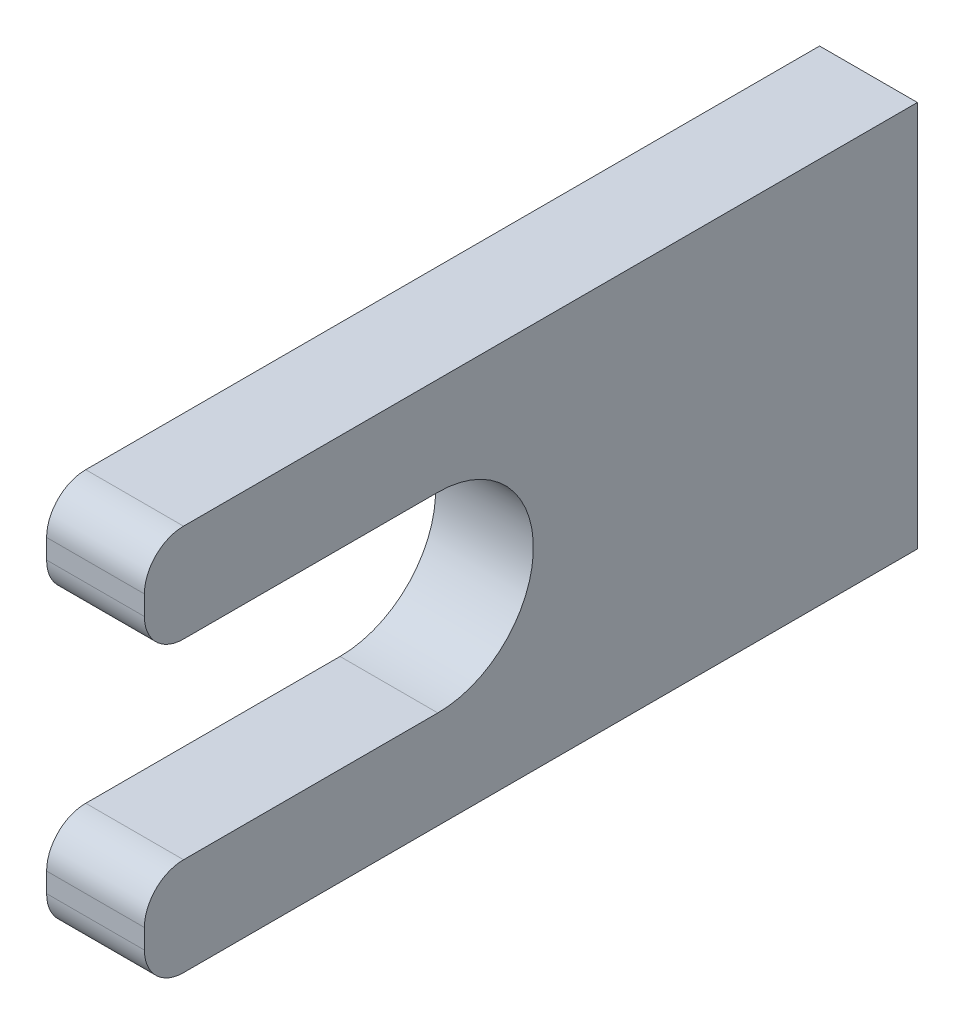
ISO-10303-21;
HEADER;
FILE_DESCRIPTION(('STEP AP214'),'2;1');
FILE_NAME('part.step','',(''),(''),'','','');
FILE_SCHEMA(('AUTOMOTIVE_DESIGN { 1 0 10303 214 1 1 1 1 }'));
ENDSEC;
DATA;
#1=APPLICATION_CONTEXT('core data for automotive mechanical design processes');
#2=APPLICATION_PROTOCOL_DEFINITION('international standard','automotive_design',2000,#1);
#3=PRODUCT_CONTEXT('',#1,'mechanical');
#4=PRODUCT('Part','Part','',(#3));
#5=PRODUCT_RELATED_PRODUCT_CATEGORY('part','',(#4));
#6=PRODUCT_DEFINITION_FORMATION('','',#4);
#7=PRODUCT_DEFINITION_CONTEXT('part definition',#1,'design');
#8=PRODUCT_DEFINITION('design','',#6,#7);
#9=PRODUCT_DEFINITION_SHAPE('','',#8);
#10=(LENGTH_UNIT() NAMED_UNIT(*) SI_UNIT(.MILLI.,.METRE.));
#11=(NAMED_UNIT(*) PLANE_ANGLE_UNIT() SI_UNIT($,.RADIAN.));
#12=(NAMED_UNIT(*) SI_UNIT($,.STERADIAN.) SOLID_ANGLE_UNIT());
#13=UNCERTAINTY_MEASURE_WITH_UNIT(LENGTH_MEASURE(1.E-05),#10,'distance_accuracy_value','');
#14=(GEOMETRIC_REPRESENTATION_CONTEXT(3) GLOBAL_UNCERTAINTY_ASSIGNED_CONTEXT((#13)) GLOBAL_UNIT_ASSIGNED_CONTEXT((#10,
#11,#12)) REPRESENTATION_CONTEXT('',''));
#15=CARTESIAN_POINT('',(0.,0.,0.));
#16=DIRECTION('',(0.,0.,1.));
#17=DIRECTION('',(1.,0.,0.));
#18=AXIS2_PLACEMENT_3D('',#15,#16,#17);
#19=CARTESIAN_POINT('',(-70.825,6.203199938,488.95));
#20=DIRECTION('',(0.,0.,-1.));
#21=DIRECTION('',(-1.,0.,0.));
#22=AXIS2_PLACEMENT_3D('',#19,#20,#21);
#23=PLANE('',#22);
#24=DIRECTION('',(0.,-1.,0.));
#25=VECTOR('',#24,1.);
#26=CARTESIAN_POINT('',(-77.175,6.203199938,488.95));
#27=LINE('',#26,#25);
#28=CARTESIAN_POINT('',(-77.175,10.013199938,488.95));
#29=VERTEX_POINT('',#28);
#30=CARTESIAN_POINT('',(-77.175,8.743199938,488.95));
#31=VERTEX_POINT('',#30);
#32=EDGE_CURVE('E166',#29,#31,#27,.T.);
#33=ORIENTED_EDGE('',*,*,#32,.T.);
#34=DIRECTION('',(-1.,0.,0.));
#35=VECTOR('',#34,1.);
#36=CARTESIAN_POINT('',(-70.825,8.743199938,488.95));
#37=LINE('',#36,#35);
#38=CARTESIAN_POINT('',(-70.825,8.743199938,488.95));
#39=VERTEX_POINT('',#38);
#40=EDGE_CURVE('E203',#31,#39,#37,.F.);
#41=ORIENTED_EDGE('',*,*,#40,.T.);
#42=DIRECTION('',(0.,-1.,0.));
#43=VECTOR('',#42,1.);
#44=CARTESIAN_POINT('',(-70.825,6.203199938,488.95));
#45=LINE('',#44,#43);
#46=CARTESIAN_POINT('',(-70.825,10.013199938,488.95));
#47=VERTEX_POINT('',#46);
#48=EDGE_CURVE('E137',#47,#39,#45,.T.);
#49=ORIENTED_EDGE('',*,*,#48,.F.);
#50=DIRECTION('',(-1.,0.,0.));
#51=VECTOR('',#50,1.);
#52=CARTESIAN_POINT('',(-70.825,10.013199938,488.95));
#53=LINE('',#52,#51);
#54=EDGE_CURVE('E200',#47,#29,#53,.T.);
#55=ORIENTED_EDGE('',*,*,#54,.T.);
#56=EDGE_LOOP('',(#33,#41,#49,#55));
#57=FACE_BOUND('',#56,.T.);
#58=ADVANCED_FACE('F36',(#57),#23,.F.);
#59=CARTESIAN_POINT('',(-70.825,6.203199938,488.95));
#60=DIRECTION('',(0.,1.,0.));
#61=DIRECTION('',(0.,0.,1.));
#62=AXIS2_PLACEMENT_3D('',#59,#60,#61);
#63=PLANE('',#62);
#64=DIRECTION('',(0.,0.,-1.));
#65=VECTOR('',#64,1.);
#66=CARTESIAN_POINT('',(-70.825,6.203199938,488.95));
#67=LINE('',#66,#65);
#68=CARTESIAN_POINT('',(-70.825,6.203199938,486.41));
#69=VERTEX_POINT('',#68);
#70=CARTESIAN_POINT('',(-70.825,6.203199938,469.9));
#71=VERTEX_POINT('',#70);
#72=EDGE_CURVE('E124',#69,#71,#67,.T.);
#73=ORIENTED_EDGE('',*,*,#72,.F.);
#74=DIRECTION('',(-1.,0.,0.));
#75=VECTOR('',#74,1.);
#76=CARTESIAN_POINT('',(-70.825,6.203199938,486.41));
#77=LINE('',#76,#75);
#78=CARTESIAN_POINT('',(-77.175,6.203199938,486.41));
#79=VERTEX_POINT('',#78);
#80=EDGE_CURVE('E146',#69,#79,#77,.T.);
#81=ORIENTED_EDGE('',*,*,#80,.T.);
#82=DIRECTION('',(0.,0.,-1.));
#83=VECTOR('',#82,1.);
#84=CARTESIAN_POINT('',(-77.175,6.203199938,488.95));
#85=LINE('',#84,#83);
#86=CARTESIAN_POINT('',(-77.175,6.203199938,469.9));
#87=VERTEX_POINT('',#86);
#88=EDGE_CURVE('E143',#79,#87,#85,.T.);
#89=ORIENTED_EDGE('',*,*,#88,.T.);
#90=DIRECTION('',(-1.,0.,0.));
#91=VECTOR('',#90,1.);
#92=CARTESIAN_POINT('',(-70.825,6.203199938,469.9));
#93=LINE('',#92,#91);
#94=EDGE_CURVE('E140',#71,#87,#93,.T.);
#95=ORIENTED_EDGE('',*,*,#94,.F.);
#96=EDGE_LOOP('',(#73,#81,#89,#95));
#97=FACE_BOUND('',#96,.T.);
#98=ADVANCED_FACE('F141',(#97),#63,.F.);
#99=CARTESIAN_POINT('',(-70.825,0.,469.9));
#100=DIRECTION('',(-1.,0.,0.));
#101=DIRECTION('',(0.,0.,1.));
#102=AXIS2_PLACEMENT_3D('',#99,#100,#101);
#103=CYLINDRICAL_SURFACE('',#102,6.203199938);
#104=CARTESIAN_POINT('',(-77.175,0.,469.9));
#105=DIRECTION('',(-1.,0.,0.));
#106=DIRECTION('',(0.,0.,1.));
#107=AXIS2_PLACEMENT_3D('',#104,#105,#106);
#108=CIRCLE('',#107,6.203199938);
#109=CARTESIAN_POINT('',(-77.175,-6.203199938,469.9));
#110=VERTEX_POINT('',#109);
#111=EDGE_CURVE('E170',#87,#110,#108,.T.);
#112=ORIENTED_EDGE('',*,*,#111,.T.);
#113=DIRECTION('',(-1.,0.,0.));
#114=VECTOR('',#113,1.);
#115=CARTESIAN_POINT('',(-70.825,-6.203199938,469.9));
#116=LINE('',#115,#114);
#117=CARTESIAN_POINT('',(-70.825,-6.203199938,469.9));
#118=VERTEX_POINT('',#117);
#119=EDGE_CURVE('E147',#118,#110,#116,.T.);
#120=ORIENTED_EDGE('',*,*,#119,.F.);
#121=CARTESIAN_POINT('',(-70.825,0.,469.9));
#122=DIRECTION('',(-1.,0.,0.));
#123=DIRECTION('',(0.,0.,1.));
#124=AXIS2_PLACEMENT_3D('',#121,#122,#123);
#125=CIRCLE('',#124,6.203199938);
#126=EDGE_CURVE('E130',#71,#118,#125,.T.);
#127=ORIENTED_EDGE('',*,*,#126,.F.);
#128=ORIENTED_EDGE('',*,*,#94,.T.);
#129=EDGE_LOOP('',(#112,#120,#127,#128));
#130=FACE_BOUND('',#129,.T.);
#131=ADVANCED_FACE('F149',(#130),#103,.F.);
#132=CARTESIAN_POINT('',(-70.825,-6.203199938,469.9));
#133=DIRECTION('',(0.,-1.,0.));
#134=DIRECTION('',(0.,0.,-1.));
#135=AXIS2_PLACEMENT_3D('',#132,#133,#134);
#136=PLANE('',#135);
#137=DIRECTION('',(0.,0.,1.));
#138=VECTOR('',#137,1.);
#139=CARTESIAN_POINT('',(-77.175,-6.203199938,469.9));
#140=LINE('',#139,#138);
#141=CARTESIAN_POINT('',(-77.175,-6.203199938,486.41));
#142=VERTEX_POINT('',#141);
#143=EDGE_CURVE('E172',#110,#142,#140,.T.);
#144=ORIENTED_EDGE('',*,*,#143,.T.);
#145=DIRECTION('',(-1.,0.,0.));
#146=VECTOR('',#145,1.);
#147=CARTESIAN_POINT('',(-70.825,-6.203199938,486.41));
#148=LINE('',#147,#146);
#149=CARTESIAN_POINT('',(-70.825,-6.203199938,486.41));
#150=VERTEX_POINT('',#149);
#151=EDGE_CURVE('E216',#142,#150,#148,.F.);
#152=ORIENTED_EDGE('',*,*,#151,.T.);
#153=DIRECTION('',(0.,0.,1.));
#154=VECTOR('',#153,1.);
#155=CARTESIAN_POINT('',(-70.825,-6.203199938,469.9));
#156=LINE('',#155,#154);
#157=EDGE_CURVE('E152',#118,#150,#156,.T.);
#158=ORIENTED_EDGE('',*,*,#157,.F.);
#159=ORIENTED_EDGE('',*,*,#119,.T.);
#160=EDGE_LOOP('',(#144,#152,#158,#159));
#161=FACE_BOUND('',#160,.T.);
#162=ADVANCED_FACE('F262',(#161),#136,.F.);
#163=CARTESIAN_POINT('',(-70.825,-6.203199938,488.95));
#164=DIRECTION('',(0.,0.,-1.));
#165=DIRECTION('',(-1.,0.,0.));
#166=AXIS2_PLACEMENT_3D('',#163,#164,#165);
#167=PLANE('',#166);
#168=DIRECTION('',(0.,-1.,0.));
#169=VECTOR('',#168,1.);
#170=CARTESIAN_POINT('',(-70.825,-6.203199938,488.95));
#171=LINE('',#170,#169);
#172=CARTESIAN_POINT('',(-70.825,-8.743199938,488.95));
#173=VERTEX_POINT('',#172);
#174=CARTESIAN_POINT('',(-70.825,-10.013199938,488.95));
#175=VERTEX_POINT('',#174);
#176=EDGE_CURVE('E154',#173,#175,#171,.T.);
#177=ORIENTED_EDGE('',*,*,#176,.F.);
#178=DIRECTION('',(-1.,0.,0.));
#179=VECTOR('',#178,1.);
#180=CARTESIAN_POINT('',(-70.825,-8.743199938,488.95));
#181=LINE('',#180,#179);
#182=CARTESIAN_POINT('',(-77.175,-8.743199938,488.95));
#183=VERTEX_POINT('',#182);
#184=EDGE_CURVE('E213',#173,#183,#181,.T.);
#185=ORIENTED_EDGE('',*,*,#184,.T.);
#186=DIRECTION('',(0.,-1.,0.));
#187=VECTOR('',#186,1.);
#188=CARTESIAN_POINT('',(-77.175,-6.203199938,488.95));
#189=LINE('',#188,#187);
#190=CARTESIAN_POINT('',(-77.175,-10.013199938,488.95));
#191=VERTEX_POINT('',#190);
#192=EDGE_CURVE('E175',#183,#191,#189,.T.);
#193=ORIENTED_EDGE('',*,*,#192,.T.);
#194=DIRECTION('',(-1.,0.,0.));
#195=VECTOR('',#194,1.);
#196=CARTESIAN_POINT('',(-70.825,-10.013199938,488.95));
#197=LINE('',#196,#195);
#198=EDGE_CURVE('E211',#191,#175,#197,.F.);
#199=ORIENTED_EDGE('',*,*,#198,.T.);
#200=EDGE_LOOP('',(#177,#185,#193,#199));
#201=FACE_BOUND('',#200,.T.);
#202=ADVANCED_FACE('F265',(#201),#167,.F.);
#203=CARTESIAN_POINT('',(-70.825,-12.553199938,488.95));
#204=DIRECTION('',(0.,1.,0.));
#205=DIRECTION('',(0.,0.,1.));
#206=AXIS2_PLACEMENT_3D('',#203,#204,#205);
#207=PLANE('',#206);
#208=DIRECTION('',(0.,0.,-1.));
#209=VECTOR('',#208,1.);
#210=CARTESIAN_POINT('',(-70.825,-12.553199938,488.95));
#211=LINE('',#210,#209);
#212=CARTESIAN_POINT('',(-70.825,-12.553199938,486.41));
#213=VERTEX_POINT('',#212);
#214=CARTESIAN_POINT('',(-70.825,-12.553199938,438.765008792406));
#215=VERTEX_POINT('',#214);
#216=EDGE_CURVE('E159',#213,#215,#211,.T.);
#217=ORIENTED_EDGE('',*,*,#216,.F.);
#218=DIRECTION('',(-1.,0.,0.));
#219=VECTOR('',#218,1.);
#220=CARTESIAN_POINT('',(-70.825,-12.553199938,486.41));
#221=LINE('',#220,#219);
#222=CARTESIAN_POINT('',(-77.175,-12.553199938,486.41));
#223=VERTEX_POINT('',#222);
#224=EDGE_CURVE('E44',#213,#223,#221,.T.);
#225=ORIENTED_EDGE('',*,*,#224,.T.);
#226=DIRECTION('',(0.,0.,-1.));
#227=VECTOR('',#226,1.);
#228=CARTESIAN_POINT('',(-77.175,-12.553199938,488.95));
#229=LINE('',#228,#227);
#230=CARTESIAN_POINT('',(-77.175,-12.553199938,438.765008792406));
#231=VERTEX_POINT('',#230);
#232=EDGE_CURVE('E178',#223,#231,#229,.T.);
#233=ORIENTED_EDGE('',*,*,#232,.T.);
#234=DIRECTION('',(-1.,0.,0.));
#235=VECTOR('',#234,1.);
#236=CARTESIAN_POINT('',(-70.825,-12.553199938,438.765008792406));
#237=LINE('',#236,#235);
#238=EDGE_CURVE('E187',#215,#231,#237,.T.);
#239=ORIENTED_EDGE('',*,*,#238,.F.);
#240=EDGE_LOOP('',(#217,#225,#233,#239));
#241=FACE_BOUND('',#240,.T.);
#242=ADVANCED_FACE('F221',(#241),#207,.F.);
#243=CARTESIAN_POINT('',(-70.825,12.553199938,438.765008792406));
#244=DIRECTION('',(0.,0.,1.));
#245=DIRECTION('',(1.,0.,0.));
#246=AXIS2_PLACEMENT_3D('',#243,#244,#245);
#247=PLANE('',#246);
#248=DIRECTION('',(0.,1.,0.));
#249=VECTOR('',#248,1.);
#250=CARTESIAN_POINT('',(-77.175,12.553199938,438.765008792406));
#251=LINE('',#250,#249);
#252=CARTESIAN_POINT('',(-77.175,12.553199938,438.765008792406));
#253=VERTEX_POINT('',#252);
#254=EDGE_CURVE('E180',#231,#253,#251,.T.);
#255=ORIENTED_EDGE('',*,*,#254,.T.);
#256=DIRECTION('',(-1.,0.,0.));
#257=VECTOR('',#256,1.);
#258=CARTESIAN_POINT('',(-70.825,12.553199938,438.765008792406));
#259=LINE('',#258,#257);
#260=CARTESIAN_POINT('',(-70.825,12.553199938,438.765008792406));
#261=VERTEX_POINT('',#260);
#262=EDGE_CURVE('E165',#261,#253,#259,.T.);
#263=ORIENTED_EDGE('',*,*,#262,.F.);
#264=DIRECTION('',(0.,1.,0.));
#265=VECTOR('',#264,1.);
#266=CARTESIAN_POINT('',(-70.825,12.553199938,438.765008792406));
#267=LINE('',#266,#265);
#268=EDGE_CURVE('E161',#215,#261,#267,.T.);
#269=ORIENTED_EDGE('',*,*,#268,.F.);
#270=ORIENTED_EDGE('',*,*,#238,.T.);
#271=EDGE_LOOP('',(#255,#263,#269,#270));
#272=FACE_BOUND('',#271,.T.);
#273=ADVANCED_FACE('F230',(#272),#247,.F.);
#274=CARTESIAN_POINT('',(-70.825,12.553199938,488.95));
#275=DIRECTION('',(0.,-1.,0.));
#276=DIRECTION('',(0.,0.,-1.));
#277=AXIS2_PLACEMENT_3D('',#274,#275,#276);
#278=PLANE('',#277);
#279=DIRECTION('',(0.,0.,1.));
#280=VECTOR('',#279,1.);
#281=CARTESIAN_POINT('',(-77.175,12.553199938,488.95));
#282=LINE('',#281,#280);
#283=CARTESIAN_POINT('',(-77.175,12.553199938,486.41));
#284=VERTEX_POINT('',#283);
#285=EDGE_CURVE('E183',#253,#284,#282,.T.);
#286=ORIENTED_EDGE('',*,*,#285,.T.);
#287=DIRECTION('',(-1.,0.,0.));
#288=VECTOR('',#287,1.);
#289=CARTESIAN_POINT('',(-70.825,12.553199938,486.41));
#290=LINE('',#289,#288);
#291=CARTESIAN_POINT('',(-70.825,12.553199938,486.41));
#292=VERTEX_POINT('',#291);
#293=EDGE_CURVE('E11',#284,#292,#290,.F.);
#294=ORIENTED_EDGE('',*,*,#293,.T.);
#295=DIRECTION('',(0.,0.,1.));
#296=VECTOR('',#295,1.);
#297=CARTESIAN_POINT('',(-70.825,12.553199938,447.861458981971));
#298=LINE('',#297,#296);
#299=EDGE_CURVE('E163',#261,#292,#298,.T.);
#300=ORIENTED_EDGE('',*,*,#299,.F.);
#301=ORIENTED_EDGE('',*,*,#262,.T.);
#302=EDGE_LOOP('',(#286,#294,#300,#301));
#303=FACE_BOUND('',#302,.T.);
#304=ADVANCED_FACE('F232',(#303),#278,.F.);
#305=CARTESIAN_POINT('',(-70.825,0.,469.9));
#306=DIRECTION('',(-1.,0.,0.));
#307=DIRECTION('',(0.,0.,1.));
#308=AXIS2_PLACEMENT_3D('',#305,#306,#307);
#309=PLANE('',#308);
#310=ORIENTED_EDGE('',*,*,#48,.T.);
#311=CARTESIAN_POINT('',(-70.825,8.743199938,486.41));
#312=DIRECTION('',(-1.,0.,0.));
#313=DIRECTION('',(0.,0.,1.));
#314=AXIS2_PLACEMENT_3D('',#311,#312,#313);
#315=CIRCLE('',#314,2.54);
#316=EDGE_CURVE('E133',#39,#69,#315,.F.);
#317=ORIENTED_EDGE('',*,*,#316,.T.);
#318=ORIENTED_EDGE('',*,*,#72,.T.);
#319=ORIENTED_EDGE('',*,*,#126,.T.);
#320=ORIENTED_EDGE('',*,*,#157,.T.);
#321=CARTESIAN_POINT('',(-70.825,-8.743199938,486.41));
#322=DIRECTION('',(-1.,0.,0.));
#323=DIRECTION('',(0.,0.,1.));
#324=AXIS2_PLACEMENT_3D('',#321,#322,#323);
#325=CIRCLE('',#324,2.54);
#326=EDGE_CURVE('E208',#150,#173,#325,.F.);
#327=ORIENTED_EDGE('',*,*,#326,.T.);
#328=ORIENTED_EDGE('',*,*,#176,.T.);
#329=CARTESIAN_POINT('',(-70.825,-10.013199938,486.41));
#330=DIRECTION('',(-1.,0.,0.));
#331=DIRECTION('',(0.,0.,1.));
#332=AXIS2_PLACEMENT_3D('',#329,#330,#331);
#333=CIRCLE('',#332,2.54);
#334=EDGE_CURVE('E57',#175,#213,#333,.F.);
#335=ORIENTED_EDGE('',*,*,#334,.T.);
#336=ORIENTED_EDGE('',*,*,#216,.T.);
#337=ORIENTED_EDGE('',*,*,#268,.T.);
#338=ORIENTED_EDGE('',*,*,#299,.T.);
#339=CARTESIAN_POINT('',(-70.825,10.013199938,486.41));
#340=DIRECTION('',(-1.,0.,0.));
#341=DIRECTION('',(0.,0.,1.));
#342=AXIS2_PLACEMENT_3D('',#339,#340,#341);
#343=CIRCLE('',#342,2.54);
#344=EDGE_CURVE('E205',#292,#47,#343,.F.);
#345=ORIENTED_EDGE('',*,*,#344,.T.);
#346=EDGE_LOOP('',(#310,#317,#318,#319,#320,#327,#328,#335,#336,#337,#338,#345));
#347=FACE_BOUND('',#346,.T.);
#348=ADVANCED_FACE('F127',(#347),#309,.F.);
#349=CARTESIAN_POINT('',(-77.175,0.,469.9));
#350=DIRECTION('',(-1.,0.,0.));
#351=DIRECTION('',(0.,0.,1.));
#352=AXIS2_PLACEMENT_3D('',#349,#350,#351);
#353=PLANE('',#352);
#354=ORIENTED_EDGE('',*,*,#88,.F.);
#355=CARTESIAN_POINT('',(-77.175,8.743199938,486.41));
#356=DIRECTION('',(-1.,0.,0.));
#357=DIRECTION('',(0.,0.,1.));
#358=AXIS2_PLACEMENT_3D('',#355,#356,#357);
#359=CIRCLE('',#358,2.54);
#360=EDGE_CURVE('E198',#79,#31,#359,.T.);
#361=ORIENTED_EDGE('',*,*,#360,.T.);
#362=ORIENTED_EDGE('',*,*,#32,.F.);
#363=CARTESIAN_POINT('',(-77.175,10.013199938,486.41));
#364=DIRECTION('',(-1.,0.,0.));
#365=DIRECTION('',(0.,0.,1.));
#366=AXIS2_PLACEMENT_3D('',#363,#364,#365);
#367=CIRCLE('',#366,2.54);
#368=EDGE_CURVE('E192',#29,#284,#367,.T.);
#369=ORIENTED_EDGE('',*,*,#368,.T.);
#370=ORIENTED_EDGE('',*,*,#285,.F.);
#371=ORIENTED_EDGE('',*,*,#254,.F.);
#372=ORIENTED_EDGE('',*,*,#232,.F.);
#373=CARTESIAN_POINT('',(-77.175,-10.013199938,486.41));
#374=DIRECTION('',(-1.,0.,0.));
#375=DIRECTION('',(0.,0.,1.));
#376=AXIS2_PLACEMENT_3D('',#373,#374,#375);
#377=CIRCLE('',#376,2.54);
#378=EDGE_CURVE('E194',#223,#191,#377,.T.);
#379=ORIENTED_EDGE('',*,*,#378,.T.);
#380=ORIENTED_EDGE('',*,*,#192,.F.);
#381=CARTESIAN_POINT('',(-77.175,-8.743199938,486.41));
#382=DIRECTION('',(-1.,0.,0.));
#383=DIRECTION('',(0.,0.,1.));
#384=AXIS2_PLACEMENT_3D('',#381,#382,#383);
#385=CIRCLE('',#384,2.54);
#386=EDGE_CURVE('E196',#183,#142,#385,.T.);
#387=ORIENTED_EDGE('',*,*,#386,.T.);
#388=ORIENTED_EDGE('',*,*,#143,.F.);
#389=ORIENTED_EDGE('',*,*,#111,.F.);
#390=EDGE_LOOP('',(#354,#361,#362,#369,#370,#371,#372,#379,#380,#387,#388,#389));
#391=FACE_BOUND('',#390,.T.);
#392=ADVANCED_FACE('F226',(#391),#353,.T.);
#393=CARTESIAN_POINT('',(-70.825,8.743199938,486.41));
#394=DIRECTION('',(-1.,0.,0.));
#395=DIRECTION('',(0.,0.,1.));
#396=AXIS2_PLACEMENT_3D('',#393,#394,#395);
#397=CYLINDRICAL_SURFACE('',#396,2.54);
#398=ORIENTED_EDGE('',*,*,#316,.F.);
#399=ORIENTED_EDGE('',*,*,#40,.F.);
#400=ORIENTED_EDGE('',*,*,#360,.F.);
#401=ORIENTED_EDGE('',*,*,#80,.F.);
#402=EDGE_LOOP('',(#398,#399,#400,#401));
#403=FACE_BOUND('',#402,.T.);
#404=ADVANCED_FACE('F241',(#403),#397,.T.);
#405=CARTESIAN_POINT('',(-70.825,-8.743199938,486.41));
#406=DIRECTION('',(-1.,0.,0.));
#407=DIRECTION('',(0.,0.,1.));
#408=AXIS2_PLACEMENT_3D('',#405,#406,#407);
#409=CYLINDRICAL_SURFACE('',#408,2.54);
#410=ORIENTED_EDGE('',*,*,#326,.F.);
#411=ORIENTED_EDGE('',*,*,#151,.F.);
#412=ORIENTED_EDGE('',*,*,#386,.F.);
#413=ORIENTED_EDGE('',*,*,#184,.F.);
#414=EDGE_LOOP('',(#410,#411,#412,#413));
#415=FACE_BOUND('',#414,.T.);
#416=ADVANCED_FACE('F243',(#415),#409,.T.);
#417=CARTESIAN_POINT('',(-70.825,-10.013199938,486.41));
#418=DIRECTION('',(-1.,0.,0.));
#419=DIRECTION('',(0.,0.,1.));
#420=AXIS2_PLACEMENT_3D('',#417,#418,#419);
#421=CYLINDRICAL_SURFACE('',#420,2.54);
#422=ORIENTED_EDGE('',*,*,#334,.F.);
#423=ORIENTED_EDGE('',*,*,#198,.F.);
#424=ORIENTED_EDGE('',*,*,#378,.F.);
#425=ORIENTED_EDGE('',*,*,#224,.F.);
#426=EDGE_LOOP('',(#422,#423,#424,#425));
#427=FACE_BOUND('',#426,.T.);
#428=ADVANCED_FACE('F249',(#427),#421,.T.);
#429=CARTESIAN_POINT('',(-70.825,10.013199938,486.41));
#430=DIRECTION('',(-1.,0.,0.));
#431=DIRECTION('',(0.,0.,1.));
#432=AXIS2_PLACEMENT_3D('',#429,#430,#431);
#433=CYLINDRICAL_SURFACE('',#432,2.54);
#434=ORIENTED_EDGE('',*,*,#344,.F.);
#435=ORIENTED_EDGE('',*,*,#293,.F.);
#436=ORIENTED_EDGE('',*,*,#368,.F.);
#437=ORIENTED_EDGE('',*,*,#54,.F.);
#438=EDGE_LOOP('',(#434,#435,#436,#437));
#439=FACE_BOUND('',#438,.T.);
#440=ADVANCED_FACE('F38',(#439),#433,.T.);
#441=CLOSED_SHELL('',(#58,#98,#131,#162,#202,#242,#273,#304,#348,#392,#404,#416,#428,#440));
#442=MANIFOLD_SOLID_BREP('B2',#441);
#443=ADVANCED_BREP_SHAPE_REPRESENTATION('',(#18,#442),#14);
#444=SHAPE_DEFINITION_REPRESENTATION(#9,#443);
ENDSEC;
END-ISO-10303-21;
